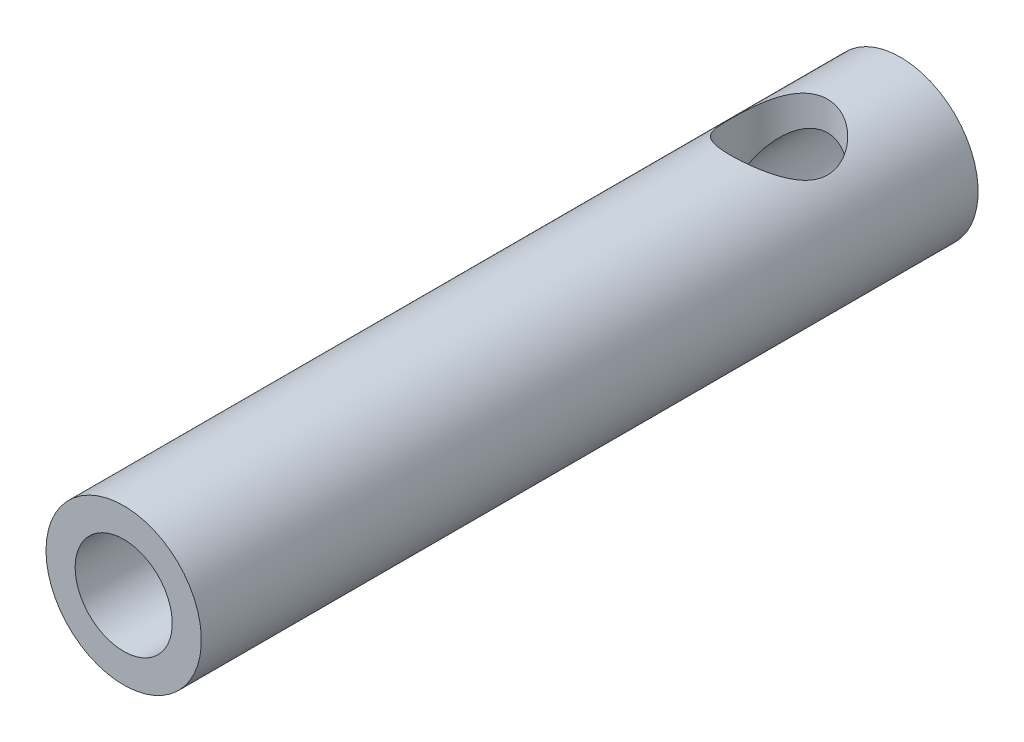
ISO-10303-21;
HEADER;
FILE_DESCRIPTION(('STEP AP214'),'2;1');
FILE_NAME('part.step','',(''),(''),'','','');
FILE_SCHEMA(('AUTOMOTIVE_DESIGN { 1 0 10303 214 1 1 1 1 }'));
ENDSEC;
DATA;
#1=APPLICATION_CONTEXT('core data for automotive mechanical design processes');
#2=APPLICATION_PROTOCOL_DEFINITION('international standard','automotive_design',2000,#1);
#3=PRODUCT_CONTEXT('',#1,'mechanical');
#4=PRODUCT('Part','Part','',(#3));
#5=PRODUCT_RELATED_PRODUCT_CATEGORY('part','',(#4));
#6=PRODUCT_DEFINITION_FORMATION('','',#4);
#7=PRODUCT_DEFINITION_CONTEXT('part definition',#1,'design');
#8=PRODUCT_DEFINITION('design','',#6,#7);
#9=PRODUCT_DEFINITION_SHAPE('','',#8);
#10=(LENGTH_UNIT() NAMED_UNIT(*) SI_UNIT(.MILLI.,.METRE.));
#11=(NAMED_UNIT(*) PLANE_ANGLE_UNIT() SI_UNIT($,.RADIAN.));
#12=(NAMED_UNIT(*) SI_UNIT($,.STERADIAN.) SOLID_ANGLE_UNIT());
#13=UNCERTAINTY_MEASURE_WITH_UNIT(LENGTH_MEASURE(1.E-05),#10,'distance_accuracy_value','');
#14=(GEOMETRIC_REPRESENTATION_CONTEXT(3) GLOBAL_UNCERTAINTY_ASSIGNED_CONTEXT((#13)) GLOBAL_UNIT_ASSIGNED_CONTEXT((#10,
#11,#12)) REPRESENTATION_CONTEXT('',''));
#15=CARTESIAN_POINT('',(0.,0.,0.));
#16=DIRECTION('',(0.,0.,1.));
#17=DIRECTION('',(1.,0.,0.));
#18=AXIS2_PLACEMENT_3D('',#15,#16,#17);
#19=CARTESIAN_POINT('',(0.,0.,0.));
#20=DIRECTION('',(0.,0.,-1.));
#21=DIRECTION('',(-1.,0.,0.));
#22=AXIS2_PLACEMENT_3D('',#19,#20,#21);
#23=CYLINDRICAL_SURFACE('',#22,1.);
#24=CARTESIAN_POINT('',(0.,0.,8.));
#25=DIRECTION('',(0.,0.,-1.));
#26=DIRECTION('',(-1.,0.,0.));
#27=AXIS2_PLACEMENT_3D('',#24,#25,#26);
#28=CIRCLE('',#27,0.999999999999999);
#29=CARTESIAN_POINT('',(-0.999999999999999,0.,8.));
#30=VERTEX_POINT('',#29);
#31=EDGE_CURVE('E45',#30,#30,#28,.T.);
#32=ORIENTED_EDGE('',*,*,#31,.F.);
#33=EDGE_LOOP('',(#32));
#34=FACE_BOUND('',#33,.T.);
#35=CARTESIAN_POINT('',(0.,0.,-8.));
#36=DIRECTION('',(0.,0.,-1.));
#37=DIRECTION('',(-1.,0.,0.));
#38=AXIS2_PLACEMENT_3D('',#35,#36,#37);
#39=CIRCLE('',#38,1.);
#40=CARTESIAN_POINT('',(-1.,0.,-8.));
#41=VERTEX_POINT('',#40);
#42=EDGE_CURVE('E65',#41,#41,#39,.T.);
#43=ORIENTED_EDGE('',*,*,#42,.T.);
#44=EDGE_LOOP('',(#43));
#45=FACE_BOUND('',#44,.T.);
#46=CARTESIAN_POINT('',(0.,0.,-5.5));
#47=DIRECTION('',(0.,0.707106781186547,-0.707106781186547));
#48=DIRECTION('',(0.,-0.707106781186547,-0.707106781186547));
#49=AXIS2_PLACEMENT_3D('',#46,#47,#48);
#50=ELLIPSE('',#49,1.41421356237309,1.);
#51=CARTESIAN_POINT('',(-1.,0.,-5.5));
#52=VERTEX_POINT('',#51);
#53=CARTESIAN_POINT('',(1.,0.,-5.5));
#54=VERTEX_POINT('',#53);
#55=EDGE_CURVE('E53',#52,#54,#50,.T.);
#56=ORIENTED_EDGE('',*,*,#55,.T.);
#57=CARTESIAN_POINT('',(0.,0.,-5.5));
#58=DIRECTION('',(0.,-0.707106781186547,-0.707106781186547));
#59=DIRECTION('',(0.,0.707106781186547,-0.707106781186547));
#60=AXIS2_PLACEMENT_3D('',#57,#58,#59);
#61=ELLIPSE('',#60,1.41421356237309,1.);
#62=EDGE_CURVE('E51',#54,#52,#61,.F.);
#63=ORIENTED_EDGE('',*,*,#62,.T.);
#64=EDGE_LOOP('',(#56,#63));
#65=FACE_BOUND('',#64,.T.);
#66=ADVANCED_FACE('F33',(#34,#45,#65),#23,.F.);
#67=CARTESIAN_POINT('',(0.,0.,0.));
#68=DIRECTION('',(0.,0.,-1.));
#69=DIRECTION('',(-1.,0.,0.));
#70=AXIS2_PLACEMENT_3D('',#67,#68,#69);
#71=CYLINDRICAL_SURFACE('',#70,1.6);
#72=CARTESIAN_POINT('',(0.,0.,8.));
#73=DIRECTION('',(0.,0.,-1.));
#74=DIRECTION('',(-1.,0.,0.));
#75=AXIS2_PLACEMENT_3D('',#72,#73,#74);
#76=CIRCLE('',#75,1.6);
#77=CARTESIAN_POINT('',(-1.6,0.,8.));
#78=VERTEX_POINT('',#77);
#79=EDGE_CURVE('E57',#78,#78,#76,.T.);
#80=ORIENTED_EDGE('',*,*,#79,.T.);
#81=EDGE_LOOP('',(#80));
#82=FACE_BOUND('',#81,.T.);
#83=CARTESIAN_POINT('',(0.,0.,-8.));
#84=DIRECTION('',(0.,0.,-1.));
#85=DIRECTION('',(-1.,0.,0.));
#86=AXIS2_PLACEMENT_3D('',#83,#84,#85);
#87=CIRCLE('',#86,1.6);
#88=CARTESIAN_POINT('',(-1.6,0.,-8.));
#89=VERTEX_POINT('',#88);
#90=EDGE_CURVE('E60',#89,#89,#87,.T.);
#91=ORIENTED_EDGE('',*,*,#90,.F.);
#92=EDGE_LOOP('',(#91));
#93=FACE_BOUND('',#92,.T.);
#94=CARTESIAN_POINT('',(0.,1.6,-6.5));
#95=CARTESIAN_POINT('',(0.0508083784001766,1.59999676244254,-6.49999652000097));
#96=CARTESIAN_POINT('',(0.10167715284309,1.59755458648825,-6.49610159054571));
#97=CARTESIAN_POINT('',(0.201854609812142,1.58801734179257,-6.48073135725644));
#98=CARTESIAN_POINT('',(0.251160130638935,1.58091340459821,-6.46924160485978));
#99=CARTESIAN_POINT('',(0.346564446509748,1.56276682385802,-6.43935090947019));
#100=CARTESIAN_POINT('',(0.392677794933212,1.55174368623284,-6.42098416972669));
#101=CARTESIAN_POINT('',(0.48100829509349,1.52667678788505,-6.3780913193632));
#102=CARTESIAN_POINT('',(0.523225877816448,1.51263336186896,-6.35356589119491));
#103=CARTESIAN_POINT('',(0.60637935373921,1.48136122323244,-6.29689074144957));
#104=CARTESIAN_POINT('',(0.646943648634678,1.46396769785212,-6.26428856001017));
#105=CARTESIAN_POINT('',(0.722389100098685,1.42825079925379,-6.19342466040424));
#106=CARTESIAN_POINT('',(0.757262485702491,1.40992619866153,-6.15515533742915));
#107=CARTESIAN_POINT('',(0.825142985975676,1.37144334947706,-6.06797288459733));
#108=CARTESIAN_POINT('',(0.857257648547256,1.35137288888043,-6.01832017055692));
#109=CARTESIAN_POINT('',(0.912591728470455,1.31464158594993,-5.91314814748501));
#110=CARTESIAN_POINT('',(0.935826167268413,1.29797500818147,-5.85763894990007));
#111=CARTESIAN_POINT('',(0.96746720463559,1.27447660486133,-5.75695158100221));
#112=CARTESIAN_POINT('',(0.978156418957155,1.26621524787839,-5.71282654517569));
#113=CARTESIAN_POINT('',(0.993454748697811,1.25425085864858,-5.62295525950463));
#114=CARTESIAN_POINT('',(0.998072450740451,1.25054138940084,-5.5772113933786));
#115=CARTESIAN_POINT('',(1.000951345962,1.24823908625128,-5.48526958660091));
#116=CARTESIAN_POINT('',(0.999195869821802,1.24965967017071,-5.43907077083057));
#117=CARTESIAN_POINT('',(0.989410536375442,1.2574192190744,-5.34775191744835));
#118=CARTESIAN_POINT('',(0.981375650120614,1.26376212613769,-5.3026327743686));
#119=CARTESIAN_POINT('',(0.959744826971532,1.28026058497346,-5.21564923787414));
#120=CARTESIAN_POINT('',(0.946280133895102,1.2903257208383,-5.17373403545262));
#121=CARTESIAN_POINT('',(0.914321518567569,1.31316453154746,-5.09267105407563));
#122=CARTESIAN_POINT('',(0.895825817549585,1.32593916401089,-5.05352426010039));
#123=CARTESIAN_POINT('',(0.850359143639566,1.35563852794409,-4.97133338093382));
#124=CARTESIAN_POINT('',(0.822450372809355,1.37289273260765,-4.92892735190369));
#125=CARTESIAN_POINT('',(0.760705170401687,1.40804569432997,-4.84893577679961));
#126=CARTESIAN_POINT('',(0.72686264640915,1.42594509868781,-4.81135525463478));
#127=CARTESIAN_POINT('',(0.647615770418661,1.46383915933485,-4.73575860050368));
#128=CARTESIAN_POINT('',(0.601225082876264,1.48369225341274,-4.69869362059293));
#129=CARTESIAN_POINT('',(0.501718479674854,1.52022444049956,-4.6329192832902));
#130=CARTESIAN_POINT('',(0.448605219105597,1.53690478011811,-4.60420664181686));
#131=CARTESIAN_POINT('',(0.339906850347796,1.56442698369053,-4.55778904929486));
#132=CARTESIAN_POINT('',(0.284610766185894,1.57553581273259,-4.53957276801505));
#133=CARTESIAN_POINT('',(0.170889723659979,1.59187943448039,-4.51298805761375));
#134=CARTESIAN_POINT('',(0.112469318673041,1.59712254392056,-4.5046056846224));
#135=CARTESIAN_POINT('',(0.00361249499246853,1.60078272432073,-4.49874731995104));
#136=CARTESIAN_POINT('',(-0.0467222193310301,1.60009729076408,-4.49983745763692));
#137=CARTESIAN_POINT('',(-0.14637769439705,1.59407121195461,-4.50950626273658));
#138=CARTESIAN_POINT('',(-0.195698523970189,1.58873088378873,-4.51808442007373));
#139=CARTESIAN_POINT('',(-0.290016856526554,1.57419241826456,-4.54179082935357));
#140=CARTESIAN_POINT('',(-0.335108007962565,1.56515336421475,-4.55664972543732));
#141=CARTESIAN_POINT('',(-0.422110624856792,1.54396547283801,-4.59223711142285));
#142=CARTESIAN_POINT('',(-0.464021556376574,1.53181611480213,-4.61296658420412));
#143=CARTESIAN_POINT('',(-0.548067245021807,1.503920098848,-4.66201216479639));
#144=CARTESIAN_POINT('',(-0.589797574274725,1.4879341185378,-4.69088285539059));
#145=CARTESIAN_POINT('',(-0.668114112173874,1.45445576001373,-4.75423509212225));
#146=CARTESIAN_POINT('',(-0.704694521033485,1.43696171861107,-4.78872287140363));
#147=CARTESIAN_POINT('',(-0.777179358418308,1.39924695770473,-4.86810803153012));
#148=CARTESIAN_POINT('',(-0.812214815518021,1.37899906731966,-4.91378976503583));
#149=CARTESIAN_POINT('',(-0.874242815085473,1.34053410198538,-5.01110062795541));
#150=CARTESIAN_POINT('',(-0.901240925749549,1.32231562657869,-5.0627256054024));
#151=CARTESIAN_POINT('',(-0.941478176094625,1.29386824251674,-5.1597537184455));
#152=CARTESIAN_POINT('',(-0.956415166923837,1.28276508955024,-5.20419260058578));
#153=CARTESIAN_POINT('',(-0.980000865641959,1.26484024531014,-5.29551451661514));
#154=CARTESIAN_POINT('',(-0.988659399865017,1.25801186594084,-5.34239360756117));
#155=CARTESIAN_POINT('',(-0.999211069229234,1.24965059990985,-5.43767222150455));
#156=CARTESIAN_POINT('',(-1.00106549570634,1.24814801339655,-5.48607886839054));
#157=CARTESIAN_POINT('',(-0.99775822973454,1.25079250487878,-5.58250476829283));
#158=CARTESIAN_POINT('',(-0.992594205201139,1.25494146076469,-5.63052388720761));
#159=CARTESIAN_POINT('',(-0.976306179227194,1.26764311017067,-5.72082383604109));
#160=CARTESIAN_POINT('',(-0.965695355998158,1.27581446440848,-5.76325544113313));
#161=CARTESIAN_POINT('',(-0.939340987756103,1.29534024348552,-5.84570804766873));
#162=CARTESIAN_POINT('',(-0.923595302395253,1.30669599538982,-5.88572803563001));
#163=CARTESIAN_POINT('',(-0.884821523516941,1.33331122309215,-5.96847739509816));
#164=CARTESIAN_POINT('',(-0.861069155643679,1.34889784399198,-6.01076023878124));
#165=CARTESIAN_POINT('',(-0.808000136291114,1.38134165129494,-6.09115069379681));
#166=CARTESIAN_POINT('',(-0.778678986293552,1.3981998582146,-6.12925489004839));
#167=CARTESIAN_POINT('',(-0.708536177132848,1.43521528584945,-6.20801140398227));
#168=CARTESIAN_POINT('',(-0.666586939397435,1.45536433447021,-6.24767267635639));
#169=CARTESIAN_POINT('',(-0.575857956820161,1.49358983245399,-6.3195958637642));
#170=CARTESIAN_POINT('',(-0.527074012110838,1.51166499491516,-6.35185319674192));
#171=CARTESIAN_POINT('',(-0.423484319913124,1.54389368781239,-6.40781690409928));
#172=CARTESIAN_POINT('',(-0.368668581645253,1.55804057084285,-6.43150880432468));
#173=CARTESIAN_POINT('',(-0.254715770183596,1.58065217310274,-6.4688575074654));
#174=CARTESIAN_POINT('',(-0.195594800885478,1.58913697142951,-6.48254978789583));
#175=CARTESIAN_POINT('',(-0.113134784979728,1.59615577734515,-6.4938393673301));
#176=CARTESIAN_POINT('',(-0.0905988870902918,1.59759337781042,-6.49614549226718));
#177=CARTESIAN_POINT('',(-0.0453793491896727,1.59951624170591,-6.49922663323008));
#178=CARTESIAN_POINT('',(-0.0226957001211681,1.60000144619127,-6.500001554488));
#179=CARTESIAN_POINT('',(0.,1.6,-6.5));
#180=B_SPLINE_CURVE_WITH_KNOTS('',3,(#94,#95,#96,#97,#98,#99,#100,#101,#102,#103,#104,#105,#106,
#107,#108,#109,#110,#111,#112,#113,#114,#115,#116,#117,#118,#119,#120,#121,#122,#123,#124,#125,
#126,#127,#128,#129,#130,#131,#132,#133,#134,#135,#136,#137,#138,#139,#140,#141,#142,#143,#144,
#145,#146,#147,#148,#149,#150,#151,#152,#153,#154,#155,#156,#157,#158,#159,#160,#161,#162,#163,
#164,#165,#166,#167,#168,#169,#170,#171,#172,#173,#174,#175,#176,#177,#178,#179),.UNSPECIFIED.,
.T.,.F.,(4,2,2,2,2,2,2,2,2,2,2,2,2,2,2,2,2,2,2,2,2,2,2,2,2,2,2,2,2,2,2,2,2,2,2,2,2,2,2,2,2,2,4),
(0.,0.152329841147306,0.304950315302769,0.456821590076109,0.608676043231037,0.772657496428974,
0.936861026605613,1.12330380681876,1.30942979683477,1.44729607101642,1.58496715763781,
1.72299858796891,1.86114067601935,1.99612671566218,2.13116054324295,2.29141960281356,
2.45184418058014,2.63873744557486,2.82555712580158,3.00227339306636,3.17873878364373,
3.32901744475927,3.47928586983693,3.62367603622907,3.76809039140642,3.92708184790311,
4.08625095060017,4.26852567088839,4.45067381755397,4.59463952248845,4.73837941928551,
4.88293579748429,5.0275402204896,5.16050535228061,5.29352597848622,5.44580418427452,
5.59820592920884,5.78080431225958,5.96351539660669,6.14653380483531,6.32889968753395,
6.39694000983853,6.46498454310339),.UNSPECIFIED.);
#181=CARTESIAN_POINT('',(0.,1.6,-6.5));
#182=VERTEX_POINT('',#181);
#183=EDGE_CURVE('E11',#182,#182,#180,.T.);
#184=ORIENTED_EDGE('',*,*,#183,.T.);
#185=EDGE_LOOP('',(#184));
#186=FACE_BOUND('',#185,.T.);
#187=ADVANCED_FACE('F74',(#82,#93,#186),#71,.T.);
#188=CARTESIAN_POINT('',(0.,1.6,8.));
#189=DIRECTION('',(0.,0.,1.));
#190=DIRECTION('',(1.,0.,0.));
#191=AXIS2_PLACEMENT_3D('',#188,#189,#190);
#192=PLANE('',#191);
#193=ORIENTED_EDGE('',*,*,#31,.T.);
#194=EDGE_LOOP('',(#193));
#195=FACE_BOUND('',#194,.T.);
#196=ORIENTED_EDGE('',*,*,#79,.F.);
#197=EDGE_LOOP('',(#196));
#198=FACE_BOUND('',#197,.T.);
#199=ADVANCED_FACE('F35',(#195,#198),#192,.T.);
#200=CARTESIAN_POINT('',(0.,1.,-8.));
#201=DIRECTION('',(0.,0.,-1.));
#202=DIRECTION('',(-1.,0.,0.));
#203=AXIS2_PLACEMENT_3D('',#200,#201,#202);
#204=PLANE('',#203);
#205=ORIENTED_EDGE('',*,*,#90,.T.);
#206=EDGE_LOOP('',(#205));
#207=FACE_BOUND('',#206,.T.);
#208=ORIENTED_EDGE('',*,*,#42,.F.);
#209=EDGE_LOOP('',(#208));
#210=FACE_BOUND('',#209,.T.);
#211=ADVANCED_FACE('F77',(#207,#210),#204,.T.);
#212=CARTESIAN_POINT('',(0.,1.6,-5.5));
#213=DIRECTION('',(0.,-1.,0.));
#214=DIRECTION('',(0.,0.,-1.));
#215=AXIS2_PLACEMENT_3D('',#212,#213,#214);
#216=CYLINDRICAL_SURFACE('',#215,1.);
#217=ORIENTED_EDGE('',*,*,#183,.F.);
#218=EDGE_LOOP('',(#217));
#219=FACE_BOUND('',#218,.T.);
#220=ORIENTED_EDGE('',*,*,#55,.F.);
#221=ORIENTED_EDGE('',*,*,#62,.F.);
#222=EDGE_LOOP('',(#220,#221));
#223=FACE_BOUND('',#222,.T.);
#224=ADVANCED_FACE('F54',(#219,#223),#216,.F.);
#225=CLOSED_SHELL('',(#66,#187,#199,#211,#224));
#226=MANIFOLD_SOLID_BREP('B2',#225);
#227=ADVANCED_BREP_SHAPE_REPRESENTATION('',(#18,#226),#14);
#228=SHAPE_DEFINITION_REPRESENTATION(#9,#227);
ENDSEC;
END-ISO-10303-21;
